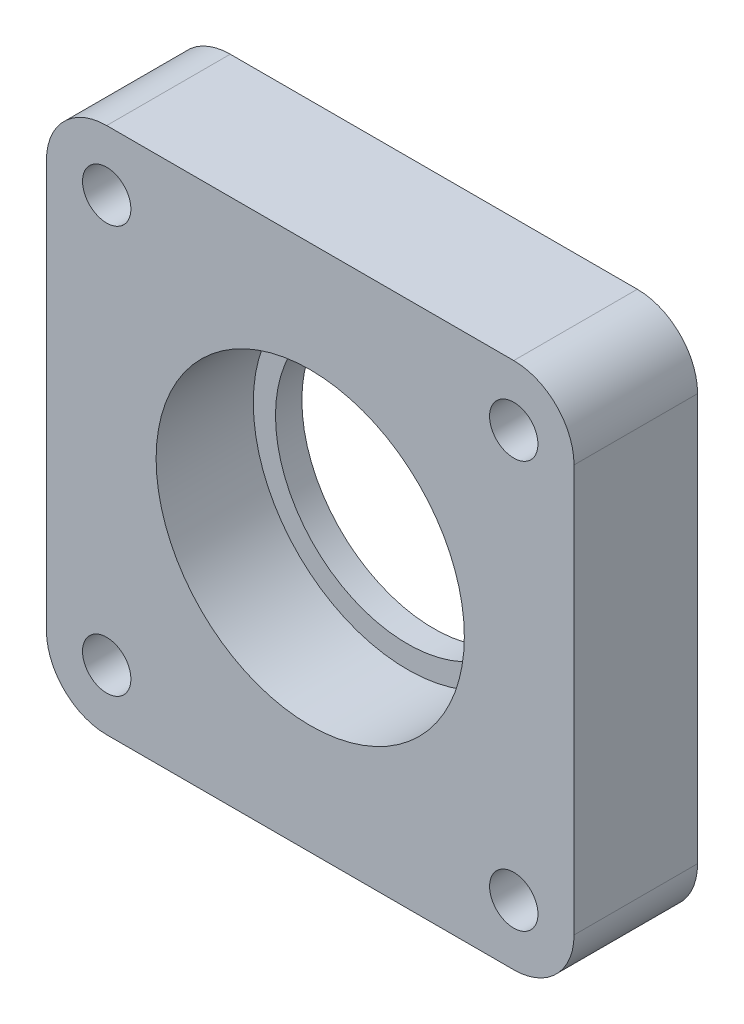
ISO-10303-21;
HEADER;
FILE_DESCRIPTION(('STEP AP214'),'2;1');
FILE_NAME('part.step','',(''),(''),'','','');
FILE_SCHEMA(('AUTOMOTIVE_DESIGN { 1 0 10303 214 1 1 1 1 }'));
ENDSEC;
DATA;
#1=APPLICATION_CONTEXT('core data for automotive mechanical design processes');
#2=APPLICATION_PROTOCOL_DEFINITION('international standard','automotive_design',2000,#1);
#3=PRODUCT_CONTEXT('',#1,'mechanical');
#4=PRODUCT('Part','Part','',(#3));
#5=PRODUCT_RELATED_PRODUCT_CATEGORY('part','',(#4));
#6=PRODUCT_DEFINITION_FORMATION('','',#4);
#7=PRODUCT_DEFINITION_CONTEXT('part definition',#1,'design');
#8=PRODUCT_DEFINITION('design','',#6,#7);
#9=PRODUCT_DEFINITION_SHAPE('','',#8);
#10=(LENGTH_UNIT() NAMED_UNIT(*) SI_UNIT(.MILLI.,.METRE.));
#11=(NAMED_UNIT(*) PLANE_ANGLE_UNIT() SI_UNIT($,.RADIAN.));
#12=(NAMED_UNIT(*) SI_UNIT($,.STERADIAN.) SOLID_ANGLE_UNIT());
#13=UNCERTAINTY_MEASURE_WITH_UNIT(LENGTH_MEASURE(1.E-05),#10,'distance_accuracy_value','');
#14=(GEOMETRIC_REPRESENTATION_CONTEXT(3) GLOBAL_UNCERTAINTY_ASSIGNED_CONTEXT((#13)) GLOBAL_UNIT_ASSIGNED_CONTEXT((#10,
#11,#12)) REPRESENTATION_CONTEXT('',''));
#15=CARTESIAN_POINT('',(0.,0.,0.));
#16=DIRECTION('',(0.,0.,1.));
#17=DIRECTION('',(1.,0.,0.));
#18=AXIS2_PLACEMENT_3D('',#15,#16,#17);
#19=CARTESIAN_POINT('',(-122.146786663737,0.959159172151811,14.05));
#20=DIRECTION('',(0.,0.,-1.));
#21=DIRECTION('',(-1.,0.,0.));
#22=AXIS2_PLACEMENT_3D('',#19,#20,#21);
#23=CYLINDRICAL_SURFACE('',#22,17.525);
#24=CARTESIAN_POINT('',(-122.146786663737,0.959159172151811,14.05));
#25=DIRECTION('',(0.,0.,1.));
#26=DIRECTION('',(1.,0.,0.));
#27=AXIS2_PLACEMENT_3D('',#24,#25,#26);
#28=CIRCLE('',#27,17.525);
#29=CARTESIAN_POINT('',(-104.621786663737,0.959159172151811,14.05));
#30=VERTEX_POINT('',#29);
#31=EDGE_CURVE('E206',#30,#30,#28,.T.);
#32=ORIENTED_EDGE('',*,*,#31,.T.);
#33=EDGE_LOOP('',(#32));
#34=FACE_BOUND('',#33,.T.);
#35=CARTESIAN_POINT('',(-122.146786663737,0.959159172151811,3.));
#36=DIRECTION('',(0.,0.,-1.));
#37=DIRECTION('',(-1.,0.,0.));
#38=AXIS2_PLACEMENT_3D('',#35,#36,#37);
#39=CIRCLE('',#38,17.525);
#40=CARTESIAN_POINT('',(-139.671786663737,0.959159172151811,3.));
#41=VERTEX_POINT('',#40);
#42=EDGE_CURVE('E40',#41,#41,#39,.T.);
#43=ORIENTED_EDGE('',*,*,#42,.T.);
#44=EDGE_LOOP('',(#43));
#45=FACE_BOUND('',#44,.T.);
#46=ADVANCED_FACE('F36',(#34,#45),#23,.F.);
#47=CARTESIAN_POINT('',(-145.291786663737,24.1041591721518,14.05));
#48=DIRECTION('',(0.,0.,1.));
#49=DIRECTION('',(1.,0.,0.));
#50=AXIS2_PLACEMENT_3D('',#47,#48,#49);
#51=PLANE('',#50);
#52=CARTESIAN_POINT('',(-99.0017866637374,24.1041591721518,14.05));
#53=DIRECTION('',(0.,0.,1.));
#54=DIRECTION('',(-1.,0.,0.));
#55=AXIS2_PLACEMENT_3D('',#52,#53,#54);
#56=CIRCLE('',#55,2.75000000000001);
#57=CARTESIAN_POINT('',(-101.751786663737,24.1041591721518,14.05));
#58=VERTEX_POINT('',#57);
#59=EDGE_CURVE('E200',#58,#58,#56,.T.);
#60=ORIENTED_EDGE('',*,*,#59,.F.);
#61=EDGE_LOOP('',(#60));
#62=FACE_BOUND('',#61,.T.);
#63=CARTESIAN_POINT('',(-145.291786663737,-22.1858408278482,14.05));
#64=DIRECTION('',(0.,0.,1.));
#65=DIRECTION('',(-1.,0.,0.));
#66=AXIS2_PLACEMENT_3D('',#63,#64,#65);
#67=CIRCLE('',#66,2.74999999999998);
#68=CARTESIAN_POINT('',(-148.041786663737,-22.1858408278482,14.05));
#69=VERTEX_POINT('',#68);
#70=EDGE_CURVE('E188',#69,#69,#67,.T.);
#71=ORIENTED_EDGE('',*,*,#70,.F.);
#72=EDGE_LOOP('',(#71));
#73=FACE_BOUND('',#72,.T.);
#74=CARTESIAN_POINT('',(-145.291786663737,24.1041591721518,14.05));
#75=DIRECTION('',(0.,0.,1.));
#76=DIRECTION('',(1.,0.,0.));
#77=AXIS2_PLACEMENT_3D('',#74,#75,#76);
#78=CIRCLE('',#77,6.855);
#79=CARTESIAN_POINT('',(-145.291786663737,30.9591591721518,14.05));
#80=VERTEX_POINT('',#79);
#81=CARTESIAN_POINT('',(-152.146786663737,24.1041591721518,14.05));
#82=VERTEX_POINT('',#81);
#83=EDGE_CURVE('E150',#80,#82,#78,.T.);
#84=ORIENTED_EDGE('',*,*,#83,.T.);
#85=DIRECTION('',(0.,-1.,0.));
#86=VECTOR('',#85,1.);
#87=CARTESIAN_POINT('',(-152.146786663737,24.1041591721518,14.05));
#88=LINE('',#87,#86);
#89=CARTESIAN_POINT('',(-152.146786663737,-22.1858408278482,14.05));
#90=VERTEX_POINT('',#89);
#91=EDGE_CURVE('E97',#82,#90,#88,.T.);
#92=ORIENTED_EDGE('',*,*,#91,.T.);
#93=CARTESIAN_POINT('',(-145.291786663737,-22.1858408278482,14.05));
#94=DIRECTION('',(0.,0.,1.));
#95=DIRECTION('',(-1.,0.,0.));
#96=AXIS2_PLACEMENT_3D('',#93,#94,#95);
#97=CIRCLE('',#96,6.855);
#98=CARTESIAN_POINT('',(-145.291786663737,-29.0408408278482,14.05));
#99=VERTEX_POINT('',#98);
#100=EDGE_CURVE('E166',#90,#99,#97,.T.);
#101=ORIENTED_EDGE('',*,*,#100,.T.);
#102=DIRECTION('',(1.,0.,0.));
#103=VECTOR('',#102,1.);
#104=CARTESIAN_POINT('',(-99.0017866637374,-29.0408408278482,14.05));
#105=LINE('',#104,#103);
#106=CARTESIAN_POINT('',(-99.0017866637374,-29.0408408278482,14.05));
#107=VERTEX_POINT('',#106);
#108=EDGE_CURVE('E179',#99,#107,#105,.T.);
#109=ORIENTED_EDGE('',*,*,#108,.T.);
#110=CARTESIAN_POINT('',(-99.0017866637374,-22.1858408278482,14.05));
#111=DIRECTION('',(0.,0.,1.));
#112=DIRECTION('',(1.,0.,0.));
#113=AXIS2_PLACEMENT_3D('',#110,#111,#112);
#114=CIRCLE('',#113,6.855);
#115=CARTESIAN_POINT('',(-92.1467866637374,-22.1858408278482,14.05));
#116=VERTEX_POINT('',#115);
#117=EDGE_CURVE('E117',#107,#116,#114,.T.);
#118=ORIENTED_EDGE('',*,*,#117,.T.);
#119=DIRECTION('',(0.,1.,0.));
#120=VECTOR('',#119,1.);
#121=CARTESIAN_POINT('',(-92.1467866637374,24.1041591721518,14.05));
#122=LINE('',#121,#120);
#123=CARTESIAN_POINT('',(-92.1467866637374,24.1041591721518,14.05));
#124=VERTEX_POINT('',#123);
#125=EDGE_CURVE('E110',#116,#124,#122,.T.);
#126=ORIENTED_EDGE('',*,*,#125,.T.);
#127=CARTESIAN_POINT('',(-99.0017866637374,24.1041591721518,14.05));
#128=DIRECTION('',(0.,0.,1.));
#129=DIRECTION('',(-1.,0.,0.));
#130=AXIS2_PLACEMENT_3D('',#127,#128,#129);
#131=CIRCLE('',#130,6.85499999999999);
#132=CARTESIAN_POINT('',(-99.0017866637374,30.9591591721518,14.05));
#133=VERTEX_POINT('',#132);
#134=EDGE_CURVE('E115',#124,#133,#131,.T.);
#135=ORIENTED_EDGE('',*,*,#134,.T.);
#136=DIRECTION('',(-1.,0.,0.));
#137=VECTOR('',#136,1.);
#138=CARTESIAN_POINT('',(-99.0017866637374,30.9591591721518,14.05));
#139=LINE('',#138,#137);
#140=EDGE_CURVE('E54',#133,#80,#139,.T.);
#141=ORIENTED_EDGE('',*,*,#140,.T.);
#142=EDGE_LOOP('',(#84,#92,#101,#109,#118,#126,#135,#141));
#143=FACE_BOUND('',#142,.T.);
#144=CARTESIAN_POINT('',(-145.291786663737,24.1041591721518,14.05));
#145=DIRECTION('',(0.,0.,1.));
#146=DIRECTION('',(1.,0.,0.));
#147=AXIS2_PLACEMENT_3D('',#144,#145,#146);
#148=CIRCLE('',#147,2.74999999999998);
#149=CARTESIAN_POINT('',(-142.541786663737,24.1041591721518,14.05));
#150=VERTEX_POINT('',#149);
#151=EDGE_CURVE('E139',#150,#150,#148,.T.);
#152=ORIENTED_EDGE('',*,*,#151,.F.);
#153=EDGE_LOOP('',(#152));
#154=FACE_BOUND('',#153,.T.);
#155=CARTESIAN_POINT('',(-99.0017866637374,-22.1858408278482,14.05));
#156=DIRECTION('',(0.,0.,1.));
#157=DIRECTION('',(1.,0.,0.));
#158=AXIS2_PLACEMENT_3D('',#155,#156,#157);
#159=CIRCLE('',#158,2.75000000000001);
#160=CARTESIAN_POINT('',(-96.2517866637374,-22.1858408278482,14.05));
#161=VERTEX_POINT('',#160);
#162=EDGE_CURVE('E194',#161,#161,#159,.T.);
#163=ORIENTED_EDGE('',*,*,#162,.F.);
#164=EDGE_LOOP('',(#163));
#165=FACE_BOUND('',#164,.T.);
#166=ORIENTED_EDGE('',*,*,#31,.F.);
#167=EDGE_LOOP('',(#166));
#168=FACE_BOUND('',#167,.T.);
#169=ADVANCED_FACE('F112',(#62,#73,#143,#154,#165,#168),#51,.T.);
#170=CARTESIAN_POINT('',(-145.291786663737,24.1041591721518,0.));
#171=DIRECTION('',(0.,0.,1.));
#172=DIRECTION('',(1.,0.,0.));
#173=AXIS2_PLACEMENT_3D('',#170,#171,#172);
#174=PLANE('',#173);
#175=CARTESIAN_POINT('',(-145.291786663737,24.1041591721518,0.));
#176=DIRECTION('',(0.,0.,1.));
#177=DIRECTION('',(1.,0.,0.));
#178=AXIS2_PLACEMENT_3D('',#175,#176,#177);
#179=CIRCLE('',#178,6.855);
#180=CARTESIAN_POINT('',(-145.291786663737,30.9591591721518,0.));
#181=VERTEX_POINT('',#180);
#182=CARTESIAN_POINT('',(-152.146786663737,24.1041591721518,0.));
#183=VERTEX_POINT('',#182);
#184=EDGE_CURVE('E135',#181,#183,#179,.T.);
#185=ORIENTED_EDGE('',*,*,#184,.F.);
#186=DIRECTION('',(-1.,0.,0.));
#187=VECTOR('',#186,1.);
#188=CARTESIAN_POINT('',(-99.0017866637374,30.9591591721518,0.));
#189=LINE('',#188,#187);
#190=CARTESIAN_POINT('',(-99.0017866637374,30.9591591721518,0.));
#191=VERTEX_POINT('',#190);
#192=EDGE_CURVE('E89',#191,#181,#189,.T.);
#193=ORIENTED_EDGE('',*,*,#192,.F.);
#194=CARTESIAN_POINT('',(-99.0017866637374,24.1041591721518,0.));
#195=DIRECTION('',(0.,0.,1.));
#196=DIRECTION('',(-1.,0.,0.));
#197=AXIS2_PLACEMENT_3D('',#194,#195,#196);
#198=CIRCLE('',#197,6.85499999999999);
#199=CARTESIAN_POINT('',(-92.1467866637374,24.1041591721518,0.));
#200=VERTEX_POINT('',#199);
#201=EDGE_CURVE('E83',#200,#191,#198,.T.);
#202=ORIENTED_EDGE('',*,*,#201,.F.);
#203=DIRECTION('',(0.,1.,0.));
#204=VECTOR('',#203,1.);
#205=CARTESIAN_POINT('',(-92.1467866637374,24.1041591721518,0.));
#206=LINE('',#205,#204);
#207=CARTESIAN_POINT('',(-92.1467866637374,-22.1858408278482,0.));
#208=VERTEX_POINT('',#207);
#209=EDGE_CURVE('E125',#208,#200,#206,.T.);
#210=ORIENTED_EDGE('',*,*,#209,.F.);
#211=CARTESIAN_POINT('',(-99.0017866637374,-22.1858408278482,0.));
#212=DIRECTION('',(0.,0.,1.));
#213=DIRECTION('',(1.,0.,0.));
#214=AXIS2_PLACEMENT_3D('',#211,#212,#213);
#215=CIRCLE('',#214,6.855);
#216=CARTESIAN_POINT('',(-99.0017866637374,-29.0408408278482,0.));
#217=VERTEX_POINT('',#216);
#218=EDGE_CURVE('E145',#217,#208,#215,.T.);
#219=ORIENTED_EDGE('',*,*,#218,.F.);
#220=DIRECTION('',(1.,0.,0.));
#221=VECTOR('',#220,1.);
#222=CARTESIAN_POINT('',(-99.0017866637374,-29.0408408278482,0.));
#223=LINE('',#222,#221);
#224=CARTESIAN_POINT('',(-145.291786663737,-29.0408408278482,0.));
#225=VERTEX_POINT('',#224);
#226=EDGE_CURVE('E143',#225,#217,#223,.T.);
#227=ORIENTED_EDGE('',*,*,#226,.F.);
#228=CARTESIAN_POINT('',(-145.291786663737,-22.1858408278482,0.));
#229=DIRECTION('',(0.,0.,1.));
#230=DIRECTION('',(-1.,0.,0.));
#231=AXIS2_PLACEMENT_3D('',#228,#229,#230);
#232=CIRCLE('',#231,6.855);
#233=CARTESIAN_POINT('',(-152.146786663737,-22.1858408278482,0.));
#234=VERTEX_POINT('',#233);
#235=EDGE_CURVE('E141',#234,#225,#232,.T.);
#236=ORIENTED_EDGE('',*,*,#235,.F.);
#237=DIRECTION('',(0.,-1.,0.));
#238=VECTOR('',#237,1.);
#239=CARTESIAN_POINT('',(-152.146786663737,24.1041591721518,0.));
#240=LINE('',#239,#238);
#241=EDGE_CURVE('E138',#183,#234,#240,.T.);
#242=ORIENTED_EDGE('',*,*,#241,.F.);
#243=EDGE_LOOP('',(#185,#193,#202,#210,#219,#227,#236,#242));
#244=FACE_BOUND('',#243,.T.);
#245=CARTESIAN_POINT('',(-145.291786663737,24.1041591721518,0.));
#246=DIRECTION('',(0.,0.,1.));
#247=DIRECTION('',(1.,0.,0.));
#248=AXIS2_PLACEMENT_3D('',#245,#246,#247);
#249=CIRCLE('',#248,2.74999999999998);
#250=CARTESIAN_POINT('',(-142.541786663737,24.1041591721518,0.));
#251=VERTEX_POINT('',#250);
#252=EDGE_CURVE('E185',#251,#251,#249,.T.);
#253=ORIENTED_EDGE('',*,*,#252,.T.);
#254=EDGE_LOOP('',(#253));
#255=FACE_BOUND('',#254,.T.);
#256=CARTESIAN_POINT('',(-145.291786663737,-22.1858408278482,0.));
#257=DIRECTION('',(0.,0.,1.));
#258=DIRECTION('',(-1.,0.,0.));
#259=AXIS2_PLACEMENT_3D('',#256,#257,#258);
#260=CIRCLE('',#259,2.74999999999998);
#261=CARTESIAN_POINT('',(-148.041786663737,-22.1858408278482,0.));
#262=VERTEX_POINT('',#261);
#263=EDGE_CURVE('E191',#262,#262,#260,.T.);
#264=ORIENTED_EDGE('',*,*,#263,.T.);
#265=EDGE_LOOP('',(#264));
#266=FACE_BOUND('',#265,.T.);
#267=CARTESIAN_POINT('',(-99.0017866637374,-22.1858408278482,0.));
#268=DIRECTION('',(0.,0.,1.));
#269=DIRECTION('',(1.,0.,0.));
#270=AXIS2_PLACEMENT_3D('',#267,#268,#269);
#271=CIRCLE('',#270,2.75000000000001);
#272=CARTESIAN_POINT('',(-96.2517866637374,-22.1858408278482,0.));
#273=VERTEX_POINT('',#272);
#274=EDGE_CURVE('E197',#273,#273,#271,.T.);
#275=ORIENTED_EDGE('',*,*,#274,.T.);
#276=EDGE_LOOP('',(#275));
#277=FACE_BOUND('',#276,.T.);
#278=CARTESIAN_POINT('',(-99.0017866637374,24.1041591721518,0.));
#279=DIRECTION('',(0.,0.,1.));
#280=DIRECTION('',(-1.,0.,0.));
#281=AXIS2_PLACEMENT_3D('',#278,#279,#280);
#282=CIRCLE('',#281,2.75000000000001);
#283=CARTESIAN_POINT('',(-101.751786663737,24.1041591721518,0.));
#284=VERTEX_POINT('',#283);
#285=EDGE_CURVE('E203',#284,#284,#282,.T.);
#286=ORIENTED_EDGE('',*,*,#285,.T.);
#287=EDGE_LOOP('',(#286));
#288=FACE_BOUND('',#287,.T.);
#289=CARTESIAN_POINT('',(-122.146786663737,0.959159172151811,0.));
#290=DIRECTION('',(0.,0.,-1.));
#291=DIRECTION('',(-1.,0.,0.));
#292=AXIS2_PLACEMENT_3D('',#289,#290,#291);
#293=CIRCLE('',#292,15.);
#294=CARTESIAN_POINT('',(-137.146786663737,0.959159172151811,0.));
#295=VERTEX_POINT('',#294);
#296=EDGE_CURVE('E211',#295,#295,#293,.T.);
#297=ORIENTED_EDGE('',*,*,#296,.F.);
#298=EDGE_LOOP('',(#297));
#299=FACE_BOUND('',#298,.T.);
#300=ADVANCED_FACE('F170',(#244,#255,#266,#277,#288,#299),#174,.F.);
#301=CARTESIAN_POINT('',(-145.291786663737,24.1041591721518,14.05));
#302=DIRECTION('',(0.,0.,-1.));
#303=DIRECTION('',(-1.,0.,0.));
#304=AXIS2_PLACEMENT_3D('',#301,#302,#303);
#305=CYLINDRICAL_SURFACE('',#304,6.855);
#306=ORIENTED_EDGE('',*,*,#184,.T.);
#307=DIRECTION('',(0.,0.,-1.));
#308=VECTOR('',#307,1.);
#309=CARTESIAN_POINT('',(-152.146786663737,24.1041591721518,14.05));
#310=LINE('',#309,#308);
#311=EDGE_CURVE('E11',#82,#183,#310,.T.);
#312=ORIENTED_EDGE('',*,*,#311,.F.);
#313=ORIENTED_EDGE('',*,*,#83,.F.);
#314=DIRECTION('',(0.,0.,-1.));
#315=VECTOR('',#314,1.);
#316=CARTESIAN_POINT('',(-145.291786663737,30.9591591721518,14.05));
#317=LINE('',#316,#315);
#318=EDGE_CURVE('E131',#80,#181,#317,.T.);
#319=ORIENTED_EDGE('',*,*,#318,.T.);
#320=EDGE_LOOP('',(#306,#312,#313,#319));
#321=FACE_BOUND('',#320,.T.);
#322=ADVANCED_FACE('F38',(#321),#305,.T.);
#323=CARTESIAN_POINT('',(-152.146786663737,24.1041591721518,14.05));
#324=DIRECTION('',(1.,0.,0.));
#325=DIRECTION('',(0.,0.,-1.));
#326=AXIS2_PLACEMENT_3D('',#323,#324,#325);
#327=PLANE('',#326);
#328=ORIENTED_EDGE('',*,*,#241,.T.);
#329=DIRECTION('',(0.,0.,-1.));
#330=VECTOR('',#329,1.);
#331=CARTESIAN_POINT('',(-152.146786663737,-22.1858408278482,14.05));
#332=LINE('',#331,#330);
#333=EDGE_CURVE('E46',#90,#234,#332,.T.);
#334=ORIENTED_EDGE('',*,*,#333,.F.);
#335=ORIENTED_EDGE('',*,*,#91,.F.);
#336=ORIENTED_EDGE('',*,*,#311,.T.);
#337=EDGE_LOOP('',(#328,#334,#335,#336));
#338=FACE_BOUND('',#337,.T.);
#339=ADVANCED_FACE('F270',(#338),#327,.F.);
#340=CARTESIAN_POINT('',(-145.291786663737,-22.1858408278482,14.05));
#341=DIRECTION('',(0.,0.,-1.));
#342=DIRECTION('',(-1.,0.,0.));
#343=AXIS2_PLACEMENT_3D('',#340,#341,#342);
#344=CYLINDRICAL_SURFACE('',#343,6.855);
#345=ORIENTED_EDGE('',*,*,#235,.T.);
#346=DIRECTION('',(0.,0.,-1.));
#347=VECTOR('',#346,1.);
#348=CARTESIAN_POINT('',(-145.291786663737,-29.0408408278482,14.05));
#349=LINE('',#348,#347);
#350=EDGE_CURVE('E157',#99,#225,#349,.T.);
#351=ORIENTED_EDGE('',*,*,#350,.F.);
#352=ORIENTED_EDGE('',*,*,#100,.F.);
#353=ORIENTED_EDGE('',*,*,#333,.T.);
#354=EDGE_LOOP('',(#345,#351,#352,#353));
#355=FACE_BOUND('',#354,.T.);
#356=ADVANCED_FACE('F164',(#355),#344,.T.);
#357=CARTESIAN_POINT('',(-99.0017866637374,-29.0408408278482,14.05));
#358=DIRECTION('',(0.,1.,0.));
#359=DIRECTION('',(0.,0.,1.));
#360=AXIS2_PLACEMENT_3D('',#357,#358,#359);
#361=PLANE('',#360);
#362=ORIENTED_EDGE('',*,*,#226,.T.);
#363=DIRECTION('',(0.,0.,-1.));
#364=VECTOR('',#363,1.);
#365=CARTESIAN_POINT('',(-99.0017866637374,-29.0408408278482,14.05));
#366=LINE('',#365,#364);
#367=EDGE_CURVE('E154',#107,#217,#366,.T.);
#368=ORIENTED_EDGE('',*,*,#367,.F.);
#369=ORIENTED_EDGE('',*,*,#108,.F.);
#370=ORIENTED_EDGE('',*,*,#350,.T.);
#371=EDGE_LOOP('',(#362,#368,#369,#370));
#372=FACE_BOUND('',#371,.T.);
#373=ADVANCED_FACE('F175',(#372),#361,.F.);
#374=CARTESIAN_POINT('',(-99.0017866637374,-22.1858408278482,14.05));
#375=DIRECTION('',(0.,0.,-1.));
#376=DIRECTION('',(-1.,0.,0.));
#377=AXIS2_PLACEMENT_3D('',#374,#375,#376);
#378=CYLINDRICAL_SURFACE('',#377,6.855);
#379=ORIENTED_EDGE('',*,*,#218,.T.);
#380=DIRECTION('',(0.,0.,-1.));
#381=VECTOR('',#380,1.);
#382=CARTESIAN_POINT('',(-92.1467866637374,-22.1858408278482,14.05));
#383=LINE('',#382,#381);
#384=EDGE_CURVE('E126',#116,#208,#383,.T.);
#385=ORIENTED_EDGE('',*,*,#384,.F.);
#386=ORIENTED_EDGE('',*,*,#117,.F.);
#387=ORIENTED_EDGE('',*,*,#367,.T.);
#388=EDGE_LOOP('',(#379,#385,#386,#387));
#389=FACE_BOUND('',#388,.T.);
#390=ADVANCED_FACE('F178',(#389),#378,.T.);
#391=CARTESIAN_POINT('',(-92.1467866637374,24.1041591721518,14.05));
#392=DIRECTION('',(-1.,0.,0.));
#393=DIRECTION('',(0.,-1.,0.));
#394=AXIS2_PLACEMENT_3D('',#391,#392,#393);
#395=PLANE('',#394);
#396=ORIENTED_EDGE('',*,*,#209,.T.);
#397=DIRECTION('',(0.,0.,-1.));
#398=VECTOR('',#397,1.);
#399=CARTESIAN_POINT('',(-92.1467866637374,24.1041591721518,14.05));
#400=LINE('',#399,#398);
#401=EDGE_CURVE('E122',#124,#200,#400,.T.);
#402=ORIENTED_EDGE('',*,*,#401,.F.);
#403=ORIENTED_EDGE('',*,*,#125,.F.);
#404=ORIENTED_EDGE('',*,*,#384,.T.);
#405=EDGE_LOOP('',(#396,#402,#403,#404));
#406=FACE_BOUND('',#405,.T.);
#407=ADVANCED_FACE('F123',(#406),#395,.F.);
#408=CARTESIAN_POINT('',(-99.0017866637374,24.1041591721518,14.05));
#409=DIRECTION('',(0.,0.,-1.));
#410=DIRECTION('',(-1.,0.,0.));
#411=AXIS2_PLACEMENT_3D('',#408,#409,#410);
#412=CYLINDRICAL_SURFACE('',#411,6.85499999999999);
#413=ORIENTED_EDGE('',*,*,#201,.T.);
#414=DIRECTION('',(0.,0.,-1.));
#415=VECTOR('',#414,1.);
#416=CARTESIAN_POINT('',(-99.0017866637374,30.9591591721518,14.05));
#417=LINE('',#416,#415);
#418=EDGE_CURVE('E127',#133,#191,#417,.T.);
#419=ORIENTED_EDGE('',*,*,#418,.F.);
#420=ORIENTED_EDGE('',*,*,#134,.F.);
#421=ORIENTED_EDGE('',*,*,#401,.T.);
#422=EDGE_LOOP('',(#413,#419,#420,#421));
#423=FACE_BOUND('',#422,.T.);
#424=ADVANCED_FACE('F129',(#423),#412,.T.);
#425=CARTESIAN_POINT('',(-99.0017866637374,30.9591591721518,14.05));
#426=DIRECTION('',(0.,-1.,0.));
#427=DIRECTION('',(0.,0.,-1.));
#428=AXIS2_PLACEMENT_3D('',#425,#426,#427);
#429=PLANE('',#428);
#430=ORIENTED_EDGE('',*,*,#192,.T.);
#431=ORIENTED_EDGE('',*,*,#318,.F.);
#432=ORIENTED_EDGE('',*,*,#140,.F.);
#433=ORIENTED_EDGE('',*,*,#418,.T.);
#434=EDGE_LOOP('',(#430,#431,#432,#433));
#435=FACE_BOUND('',#434,.T.);
#436=ADVANCED_FACE('F254',(#435),#429,.F.);
#437=CARTESIAN_POINT('',(-145.291786663737,24.1041591721518,14.05));
#438=DIRECTION('',(0.,0.,-1.));
#439=DIRECTION('',(-1.,0.,0.));
#440=AXIS2_PLACEMENT_3D('',#437,#438,#439);
#441=CYLINDRICAL_SURFACE('',#440,2.74999999999998);
#442=ORIENTED_EDGE('',*,*,#151,.T.);
#443=EDGE_LOOP('',(#442));
#444=FACE_BOUND('',#443,.T.);
#445=ORIENTED_EDGE('',*,*,#252,.F.);
#446=EDGE_LOOP('',(#445));
#447=FACE_BOUND('',#446,.T.);
#448=ADVANCED_FACE('F251',(#444,#447),#441,.F.);
#449=CARTESIAN_POINT('',(-145.291786663737,-22.1858408278482,14.05));
#450=DIRECTION('',(0.,0.,-1.));
#451=DIRECTION('',(-1.,0.,0.));
#452=AXIS2_PLACEMENT_3D('',#449,#450,#451);
#453=CYLINDRICAL_SURFACE('',#452,2.74999999999998);
#454=ORIENTED_EDGE('',*,*,#70,.T.);
#455=EDGE_LOOP('',(#454));
#456=FACE_BOUND('',#455,.T.);
#457=ORIENTED_EDGE('',*,*,#263,.F.);
#458=EDGE_LOOP('',(#457));
#459=FACE_BOUND('',#458,.T.);
#460=ADVANCED_FACE('F247',(#456,#459),#453,.F.);
#461=CARTESIAN_POINT('',(-99.0017866637374,-22.1858408278482,14.05));
#462=DIRECTION('',(0.,0.,-1.));
#463=DIRECTION('',(-1.,0.,0.));
#464=AXIS2_PLACEMENT_3D('',#461,#462,#463);
#465=CYLINDRICAL_SURFACE('',#464,2.75000000000001);
#466=ORIENTED_EDGE('',*,*,#162,.T.);
#467=EDGE_LOOP('',(#466));
#468=FACE_BOUND('',#467,.T.);
#469=ORIENTED_EDGE('',*,*,#274,.F.);
#470=EDGE_LOOP('',(#469));
#471=FACE_BOUND('',#470,.T.);
#472=ADVANCED_FACE('F233',(#468,#471),#465,.F.);
#473=CARTESIAN_POINT('',(-99.0017866637374,24.1041591721518,14.05));
#474=DIRECTION('',(0.,0.,-1.));
#475=DIRECTION('',(-1.,0.,0.));
#476=AXIS2_PLACEMENT_3D('',#473,#474,#475);
#477=CYLINDRICAL_SURFACE('',#476,2.75000000000001);
#478=ORIENTED_EDGE('',*,*,#59,.T.);
#479=EDGE_LOOP('',(#478));
#480=FACE_BOUND('',#479,.T.);
#481=ORIENTED_EDGE('',*,*,#285,.F.);
#482=EDGE_LOOP('',(#481));
#483=FACE_BOUND('',#482,.T.);
#484=ADVANCED_FACE('F225',(#480,#483),#477,.F.);
#485=CARTESIAN_POINT('',(-122.146786663737,0.959159172151811,3.));
#486=DIRECTION('',(0.,0.,-1.));
#487=DIRECTION('',(-1.,0.,0.));
#488=AXIS2_PLACEMENT_3D('',#485,#486,#487);
#489=PLANE('',#488);
#490=CARTESIAN_POINT('',(-122.146786663737,0.959159172151811,3.));
#491=DIRECTION('',(0.,0.,-1.));
#492=DIRECTION('',(-1.,0.,0.));
#493=AXIS2_PLACEMENT_3D('',#490,#491,#492);
#494=CIRCLE('',#493,15.);
#495=CARTESIAN_POINT('',(-137.146786663737,0.959159172151811,3.));
#496=VERTEX_POINT('',#495);
#497=EDGE_CURVE('E214',#496,#496,#494,.T.);
#498=ORIENTED_EDGE('',*,*,#497,.T.);
#499=EDGE_LOOP('',(#498));
#500=FACE_BOUND('',#499,.T.);
#501=ORIENTED_EDGE('',*,*,#42,.F.);
#502=EDGE_LOOP('',(#501));
#503=FACE_BOUND('',#502,.T.);
#504=ADVANCED_FACE('F222',(#500,#503),#489,.F.);
#505=CARTESIAN_POINT('',(-122.146786663737,0.959159172151811,3.));
#506=DIRECTION('',(0.,0.,-1.));
#507=DIRECTION('',(-1.,0.,0.));
#508=AXIS2_PLACEMENT_3D('',#505,#506,#507);
#509=CYLINDRICAL_SURFACE('',#508,15.);
#510=ORIENTED_EDGE('',*,*,#497,.F.);
#511=EDGE_LOOP('',(#510));
#512=FACE_BOUND('',#511,.T.);
#513=ORIENTED_EDGE('',*,*,#296,.T.);
#514=EDGE_LOOP('',(#513));
#515=FACE_BOUND('',#514,.T.);
#516=ADVANCED_FACE('F224',(#512,#515),#509,.F.);
#517=CLOSED_SHELL('',(#46,#169,#300,#322,#339,#356,#373,#390,#407,#424,#436,#448,#460,#472,#484,
#504,#516));
#518=MANIFOLD_SOLID_BREP('B2',#517);
#519=ADVANCED_BREP_SHAPE_REPRESENTATION('',(#18,#518),#14);
#520=SHAPE_DEFINITION_REPRESENTATION(#9,#519);
ENDSEC;
END-ISO-10303-21;
